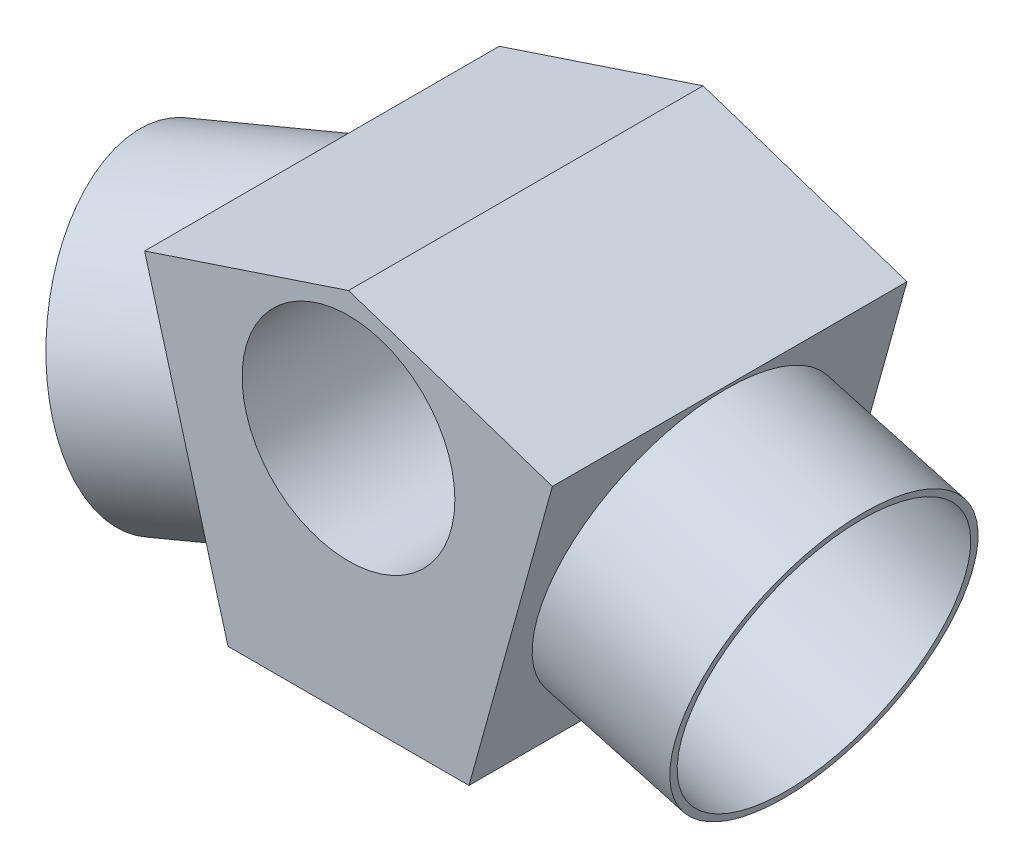
ISO-10303-21;
HEADER;
FILE_DESCRIPTION(('STEP AP214'),'2;1');
FILE_NAME('part.step','',(''),(''),'','','');
FILE_SCHEMA(('AUTOMOTIVE_DESIGN { 1 0 10303 214 1 1 1 1 }'));
ENDSEC;
DATA;
#1=APPLICATION_CONTEXT('core data for automotive mechanical design processes');
#2=APPLICATION_PROTOCOL_DEFINITION('international standard','automotive_design',2000,#1);
#3=PRODUCT_CONTEXT('',#1,'mechanical');
#4=PRODUCT('Part','Part','',(#3));
#5=PRODUCT_RELATED_PRODUCT_CATEGORY('part','',(#4));
#6=PRODUCT_DEFINITION_FORMATION('','',#4);
#7=PRODUCT_DEFINITION_CONTEXT('part definition',#1,'design');
#8=PRODUCT_DEFINITION('design','',#6,#7);
#9=PRODUCT_DEFINITION_SHAPE('','',#8);
#10=(LENGTH_UNIT() NAMED_UNIT(*) SI_UNIT(.MILLI.,.METRE.));
#11=(NAMED_UNIT(*) PLANE_ANGLE_UNIT() SI_UNIT($,.RADIAN.));
#12=(NAMED_UNIT(*) SI_UNIT($,.STERADIAN.) SOLID_ANGLE_UNIT());
#13=UNCERTAINTY_MEASURE_WITH_UNIT(LENGTH_MEASURE(1.E-05),#10,'distance_accuracy_value','');
#14=(GEOMETRIC_REPRESENTATION_CONTEXT(3) GLOBAL_UNCERTAINTY_ASSIGNED_CONTEXT((#13)) GLOBAL_UNIT_ASSIGNED_CONTEXT((#10,
#11,#12)) REPRESENTATION_CONTEXT('',''));
#15=CARTESIAN_POINT('',(0.,0.,0.));
#16=DIRECTION('',(0.,0.,1.));
#17=DIRECTION('',(1.,0.,0.));
#18=AXIS2_PLACEMENT_3D('',#15,#16,#17);
#19=CARTESIAN_POINT('',(0.,9.02241335596712,-25.));
#20=DIRECTION('',(0.315177046038834,0.949032891764155,0.));
#21=DIRECTION('',(-0.949032891764155,0.315177046038834,0.));
#22=AXIS2_PLACEMENT_3D('',#19,#20,#21);
#23=PLANE('',#22);
#24=DIRECTION('',(-0.949032891764155,0.315177046038834,0.));
#25=VECTOR('',#24,1.);
#26=CARTESIAN_POINT('',(0.,9.02241335596712,0.));
#27=LINE('',#26,#25);
#28=CARTESIAN_POINT('',(14.3742711389531,4.24866909920602,0.));
#29=VERTEX_POINT('',#28);
#30=CARTESIAN_POINT('',(0.,9.02241335596712,0.));
#31=VERTEX_POINT('',#30);
#32=EDGE_CURVE('E133',#29,#31,#27,.T.);
#33=ORIENTED_EDGE('',*,*,#32,.F.);
#34=DIRECTION('',(0.,0.,1.));
#35=VECTOR('',#34,1.);
#36=CARTESIAN_POINT('',(14.3742711389531,4.24866909920602,-25.));
#37=LINE('',#36,#35);
#38=CARTESIAN_POINT('',(14.3742711389531,4.24866909920602,-25.));
#39=VERTEX_POINT('',#38);
#40=EDGE_CURVE('E70',#39,#29,#37,.T.);
#41=ORIENTED_EDGE('',*,*,#40,.F.);
#42=DIRECTION('',(-0.949032891764155,0.315177046038834,0.));
#43=VECTOR('',#42,1.);
#44=CARTESIAN_POINT('',(0.,9.02241335596712,-25.));
#45=LINE('',#44,#43);
#46=CARTESIAN_POINT('',(0.,9.02241335596712,-25.));
#47=VERTEX_POINT('',#46);
#48=EDGE_CURVE('E128',#39,#47,#45,.T.);
#49=ORIENTED_EDGE('',*,*,#48,.T.);
#50=DIRECTION('',(0.,0.,1.));
#51=VECTOR('',#50,1.);
#52=CARTESIAN_POINT('',(0.,9.02241335596712,-25.));
#53=LINE('',#52,#51);
#54=EDGE_CURVE('E102',#47,#31,#53,.T.);
#55=ORIENTED_EDGE('',*,*,#54,.T.);
#56=EDGE_LOOP('',(#33,#41,#49,#55));
#57=FACE_BOUND('',#56,.T.);
#58=ADVANCED_FACE('F54',(#57),#23,.T.);
#59=CARTESIAN_POINT('',(14.3742711389531,4.24866909920602,-25.));
#60=DIRECTION('',(0.963630453208622,-0.267238376078261,0.));
#61=DIRECTION('',(0.267238376078261,0.963630453208622,0.));
#62=AXIS2_PLACEMENT_3D('',#59,#60,#61);
#63=PLANE('',#62);
#64=CARTESIAN_POINT('',(11.5001030027421,-6.11524638456314,-12.3158082499231));
#65=DIRECTION('',(0.963630453208622,-0.267238376078261,0.));
#66=DIRECTION('',(0.267238376078261,0.963630453208622,0.));
#67=AXIS2_PLACEMENT_3D('',#64,#65,#66);
#68=CIRCLE('',#67,10.5);
#69=CARTESIAN_POINT('',(14.3061059515638,4.00287337412739,-12.3158082499231));
#70=VERTEX_POINT('',#69);
#71=EDGE_CURVE('E12',#70,#70,#68,.T.);
#72=ORIENTED_EDGE('',*,*,#71,.F.);
#73=EDGE_LOOP('',(#72));
#74=FACE_BOUND('',#73,.T.);
#75=DIRECTION('',(0.267238376078261,0.963630453208622,0.));
#76=VECTOR('',#75,1.);
#77=CARTESIAN_POINT('',(14.3742711389531,4.24866909920602,0.));
#78=LINE('',#77,#76);
#79=CARTESIAN_POINT('',(8.4950268652314,-16.9512008713837,0.));
#80=VERTEX_POINT('',#79);
#81=EDGE_CURVE('E143',#80,#29,#78,.T.);
#82=ORIENTED_EDGE('',*,*,#81,.F.);
#83=DIRECTION('',(0.,0.,1.));
#84=VECTOR('',#83,1.);
#85=CARTESIAN_POINT('',(8.4950268652314,-16.9512008713837,-25.));
#86=LINE('',#85,#84);
#87=CARTESIAN_POINT('',(8.4950268652314,-16.9512008713837,-25.));
#88=VERTEX_POINT('',#87);
#89=EDGE_CURVE('E90',#88,#80,#86,.T.);
#90=ORIENTED_EDGE('',*,*,#89,.F.);
#91=DIRECTION('',(0.267238376078261,0.963630453208622,0.));
#92=VECTOR('',#91,1.);
#93=CARTESIAN_POINT('',(14.3742711389531,4.24866909920602,-25.));
#94=LINE('',#93,#92);
#95=EDGE_CURVE('E123',#88,#39,#94,.T.);
#96=ORIENTED_EDGE('',*,*,#95,.T.);
#97=ORIENTED_EDGE('',*,*,#40,.T.);
#98=EDGE_LOOP('',(#82,#90,#96,#97));
#99=FACE_BOUND('',#98,.T.);
#100=ADVANCED_FACE('F170',(#74,#99),#63,.T.);
#101=CARTESIAN_POINT('',(-8.4950268652314,-16.9512008713837,-25.));
#102=DIRECTION('',(0.,-1.,0.));
#103=DIRECTION('',(0.,0.,-1.));
#104=AXIS2_PLACEMENT_3D('',#101,#102,#103);
#105=PLANE('',#104);
#106=DIRECTION('',(1.,0.,0.));
#107=VECTOR('',#106,1.);
#108=CARTESIAN_POINT('',(-8.4950268652314,-16.9512008713837,0.));
#109=LINE('',#108,#107);
#110=CARTESIAN_POINT('',(-8.4950268652314,-16.9512008713837,0.));
#111=VERTEX_POINT('',#110);
#112=EDGE_CURVE('E112',#111,#80,#109,.T.);
#113=ORIENTED_EDGE('',*,*,#112,.F.);
#114=DIRECTION('',(0.,0.,1.));
#115=VECTOR('',#114,1.);
#116=CARTESIAN_POINT('',(-8.4950268652314,-16.9512008713837,-25.));
#117=LINE('',#116,#115);
#118=CARTESIAN_POINT('',(-8.4950268652314,-16.9512008713837,-25.));
#119=VERTEX_POINT('',#118);
#120=EDGE_CURVE('E107',#119,#111,#117,.T.);
#121=ORIENTED_EDGE('',*,*,#120,.F.);
#122=DIRECTION('',(1.,0.,0.));
#123=VECTOR('',#122,1.);
#124=CARTESIAN_POINT('',(-8.4950268652314,-16.9512008713837,-25.));
#125=LINE('',#124,#123);
#126=EDGE_CURVE('E110',#119,#88,#125,.T.);
#127=ORIENTED_EDGE('',*,*,#126,.T.);
#128=ORIENTED_EDGE('',*,*,#89,.T.);
#129=EDGE_LOOP('',(#113,#121,#127,#128));
#130=FACE_BOUND('',#129,.T.);
#131=ADVANCED_FACE('F109',(#130),#105,.T.);
#132=CARTESIAN_POINT('',(-14.3742711389531,4.24866909920602,-25.));
#133=DIRECTION('',(-0.963630453208622,-0.267238376078261,0.));
#134=DIRECTION('',(0.267238376078261,-0.963630453208622,0.));
#135=AXIS2_PLACEMENT_3D('',#132,#133,#134);
#136=PLANE('',#135);
#137=CARTESIAN_POINT('',(-11.4346490020923,-6.35126588608882,-12.5));
#138=DIRECTION('',(-0.963630453208622,-0.267238376078261,0.));
#139=DIRECTION('',(0.,0.,1.));
#140=AXIS2_PLACEMENT_3D('',#137,#138,#139);
#141=ELLIPSE('',#140,10.7779978073166,10.5);
#142=CARTESIAN_POINT('',(-11.4346490020923,-6.35126588608882,-1.72200219268343));
#143=VERTEX_POINT('',#142);
#144=EDGE_CURVE('E151',#143,#143,#141,.F.);
#145=ORIENTED_EDGE('',*,*,#144,.T.);
#146=EDGE_LOOP('',(#145));
#147=FACE_BOUND('',#146,.T.);
#148=DIRECTION('',(0.267238376078261,-0.963630453208622,0.));
#149=VECTOR('',#148,1.);
#150=CARTESIAN_POINT('',(-14.3742711389531,4.24866909920602,0.));
#151=LINE('',#150,#149);
#152=CARTESIAN_POINT('',(-14.3742711389531,4.24866909920602,0.));
#153=VERTEX_POINT('',#152);
#154=EDGE_CURVE('E140',#153,#111,#151,.T.);
#155=ORIENTED_EDGE('',*,*,#154,.F.);
#156=DIRECTION('',(0.,0.,1.));
#157=VECTOR('',#156,1.);
#158=CARTESIAN_POINT('',(-14.3742711389531,4.24866909920602,-25.));
#159=LINE('',#158,#157);
#160=CARTESIAN_POINT('',(-14.3742711389531,4.24866909920602,-25.));
#161=VERTEX_POINT('',#160);
#162=EDGE_CURVE('E117',#161,#153,#159,.T.);
#163=ORIENTED_EDGE('',*,*,#162,.F.);
#164=DIRECTION('',(0.267238376078261,-0.963630453208622,0.));
#165=VECTOR('',#164,1.);
#166=CARTESIAN_POINT('',(-14.3742711389531,4.24866909920602,-25.));
#167=LINE('',#166,#165);
#168=EDGE_CURVE('E122',#161,#119,#167,.T.);
#169=ORIENTED_EDGE('',*,*,#168,.T.);
#170=ORIENTED_EDGE('',*,*,#120,.T.);
#171=EDGE_LOOP('',(#155,#163,#169,#170));
#172=FACE_BOUND('',#171,.T.);
#173=ADVANCED_FACE('F125',(#147,#172),#136,.T.);
#174=CARTESIAN_POINT('',(0.,9.02241335596712,-25.));
#175=DIRECTION('',(-0.315177046038834,0.949032891764155,0.));
#176=DIRECTION('',(-0.949032891764155,-0.315177046038834,0.));
#177=AXIS2_PLACEMENT_3D('',#174,#175,#176);
#178=PLANE('',#177);
#179=DIRECTION('',(-0.949032891764155,-0.315177046038834,0.));
#180=VECTOR('',#179,1.);
#181=CARTESIAN_POINT('',(0.,9.02241335596712,0.));
#182=LINE('',#181,#180);
#183=EDGE_CURVE('E136',#31,#153,#182,.T.);
#184=ORIENTED_EDGE('',*,*,#183,.F.);
#185=ORIENTED_EDGE('',*,*,#54,.F.);
#186=DIRECTION('',(-0.949032891764155,-0.315177046038834,0.));
#187=VECTOR('',#186,1.);
#188=CARTESIAN_POINT('',(0.,9.02241335596712,-25.));
#189=LINE('',#188,#187);
#190=EDGE_CURVE('E126',#47,#161,#189,.T.);
#191=ORIENTED_EDGE('',*,*,#190,.T.);
#192=ORIENTED_EDGE('',*,*,#162,.T.);
#193=EDGE_LOOP('',(#184,#185,#191,#192));
#194=FACE_BOUND('',#193,.T.);
#195=ADVANCED_FACE('F173',(#194),#178,.T.);
#196=CARTESIAN_POINT('',(0.,0.,-25.));
#197=DIRECTION('',(0.,0.,-1.));
#198=DIRECTION('',(-1.,0.,0.));
#199=AXIS2_PLACEMENT_3D('',#196,#197,#198);
#200=PLANE('',#199);
#201=CARTESIAN_POINT('',(0.,0.,-25.));
#202=DIRECTION('',(0.,0.,1.));
#203=DIRECTION('',(1.,0.,0.));
#204=AXIS2_PLACEMENT_3D('',#201,#202,#203);
#205=CIRCLE('',#204,7.5);
#206=CARTESIAN_POINT('',(7.5,0.,-25.));
#207=VERTEX_POINT('',#206);
#208=EDGE_CURVE('E137',#207,#207,#205,.T.);
#209=ORIENTED_EDGE('',*,*,#208,.T.);
#210=EDGE_LOOP('',(#209));
#211=FACE_BOUND('',#210,.T.);
#212=ORIENTED_EDGE('',*,*,#48,.F.);
#213=ORIENTED_EDGE('',*,*,#95,.F.);
#214=ORIENTED_EDGE('',*,*,#126,.F.);
#215=ORIENTED_EDGE('',*,*,#168,.F.);
#216=ORIENTED_EDGE('',*,*,#190,.F.);
#217=EDGE_LOOP('',(#212,#213,#214,#215,#216));
#218=FACE_BOUND('',#217,.T.);
#219=ADVANCED_FACE('F121',(#211,#218),#200,.T.);
#220=CARTESIAN_POINT('',(0.,0.,0.));
#221=DIRECTION('',(0.,0.,-1.));
#222=DIRECTION('',(-1.,0.,0.));
#223=AXIS2_PLACEMENT_3D('',#220,#221,#222);
#224=PLANE('',#223);
#225=CARTESIAN_POINT('',(0.,0.,0.));
#226=DIRECTION('',(0.,0.,1.));
#227=DIRECTION('',(1.,0.,0.));
#228=AXIS2_PLACEMENT_3D('',#225,#226,#227);
#229=CIRCLE('',#228,7.5);
#230=CARTESIAN_POINT('',(7.5,0.,0.));
#231=VERTEX_POINT('',#230);
#232=EDGE_CURVE('E153',#231,#231,#229,.T.);
#233=ORIENTED_EDGE('',*,*,#232,.F.);
#234=EDGE_LOOP('',(#233));
#235=FACE_BOUND('',#234,.T.);
#236=ORIENTED_EDGE('',*,*,#32,.T.);
#237=ORIENTED_EDGE('',*,*,#183,.T.);
#238=ORIENTED_EDGE('',*,*,#154,.T.);
#239=ORIENTED_EDGE('',*,*,#112,.T.);
#240=ORIENTED_EDGE('',*,*,#81,.T.);
#241=EDGE_LOOP('',(#236,#237,#238,#239,#240));
#242=FACE_BOUND('',#241,.T.);
#243=ADVANCED_FACE('F172',(#235,#242),#224,.F.);
#244=CARTESIAN_POINT('',(0.,0.,-25.));
#245=DIRECTION('',(0.,0.,1.));
#246=DIRECTION('',(1.,0.,0.));
#247=AXIS2_PLACEMENT_3D('',#244,#245,#246);
#248=CYLINDRICAL_SURFACE('',#247,7.5);
#249=ORIENTED_EDGE('',*,*,#208,.F.);
#250=EDGE_LOOP('',(#249));
#251=FACE_BOUND('',#250,.T.);
#252=ORIENTED_EDGE('',*,*,#232,.T.);
#253=EDGE_LOOP('',(#252));
#254=FACE_BOUND('',#253,.T.);
#255=ADVANCED_FACE('F196',(#251,#254),#248,.F.);
#256=CARTESIAN_POINT('',(-8.61832264735264,-5.57022946383693,-13.1769696970433));
#257=DIRECTION('',(-0.938775451579877,-0.260345474083962,0.225656565681116));
#258=DIRECTION('',(0.267238376078261,-0.963630453208622,0.));
#259=AXIS2_PLACEMENT_3D('',#256,#257,#258);
#260=CYLINDRICAL_SURFACE('',#259,10.5);
#261=ORIENTED_EDGE('',*,*,#144,.F.);
#262=EDGE_LOOP('',(#261));
#263=FACE_BOUND('',#262,.T.);
#264=CARTESIAN_POINT('',(-22.6999544210508,-9.47541157509637,-9.79212121182661));
#265=DIRECTION('',(0.938775451579877,0.260345474083962,-0.225656565681116));
#266=DIRECTION('',(0.267238376078261,-0.963630453208622,0.));
#267=AXIS2_PLACEMENT_3D('',#264,#265,#266);
#268=CIRCLE('',#267,10.5);
#269=CARTESIAN_POINT('',(-19.8939514722291,-19.5935313337869,-9.79212121182661));
#270=VERTEX_POINT('',#269);
#271=EDGE_CURVE('E154',#270,#270,#268,.T.);
#272=ORIENTED_EDGE('',*,*,#271,.T.);
#273=EDGE_LOOP('',(#272));
#274=FACE_BOUND('',#273,.T.);
#275=ADVANCED_FACE('F201',(#263,#274),#260,.T.);
#276=CARTESIAN_POINT('',(-8.61832264735264,-5.57022946383693,-13.1769696970433));
#277=DIRECTION('',(-0.938775451579877,-0.260345474083962,0.225656565681116));
#278=DIRECTION('',(0.267238376078261,-0.963630453208622,0.));
#279=AXIS2_PLACEMENT_3D('',#276,#277,#278);
#280=CYLINDRICAL_SURFACE('',#279,10.);
#281=CARTESIAN_POINT('',(-11.4346490020923,-6.35126588608882,-12.5));
#282=DIRECTION('',(-0.963630453208622,-0.267238376078261,0.));
#283=DIRECTION('',(0.,0.,1.));
#284=AXIS2_PLACEMENT_3D('',#281,#282,#283);
#285=ELLIPSE('',#284,10.264759816492,10.);
#286=CARTESIAN_POINT('',(-11.4346490020923,-6.35126588608882,-2.23524018350803));
#287=VERTEX_POINT('',#286);
#288=EDGE_CURVE('E62',#287,#287,#285,.F.);
#289=ORIENTED_EDGE('',*,*,#288,.T.);
#290=EDGE_LOOP('',(#289));
#291=FACE_BOUND('',#290,.T.);
#292=CARTESIAN_POINT('',(-22.6999544210508,-9.47541157509637,-9.79212121182661));
#293=DIRECTION('',(0.938775451579877,0.260345474083962,-0.225656565681116));
#294=DIRECTION('',(-0.267238376078261,0.963630453208622,0.));
#295=AXIS2_PLACEMENT_3D('',#292,#293,#294);
#296=CIRCLE('',#295,10.);
#297=CARTESIAN_POINT('',(-25.3723381818334,0.160892956989858,-9.79212121182661));
#298=VERTEX_POINT('',#297);
#299=EDGE_CURVE('E160',#298,#298,#296,.T.);
#300=ORIENTED_EDGE('',*,*,#299,.F.);
#301=EDGE_LOOP('',(#300));
#302=FACE_BOUND('',#301,.T.);
#303=ADVANCED_FACE('F205',(#291,#302),#280,.F.);
#304=CARTESIAN_POINT('',(-22.6999544210508,-9.47541157509637,-9.79212121182661));
#305=DIRECTION('',(0.938775451579877,0.260345474083962,-0.225656565681116));
#306=DIRECTION('',(-0.267238376078261,0.963630453208622,0.));
#307=AXIS2_PLACEMENT_3D('',#304,#305,#306);
#308=PLANE('',#307);
#309=ORIENTED_EDGE('',*,*,#299,.T.);
#310=EDGE_LOOP('',(#309));
#311=FACE_BOUND('',#310,.T.);
#312=ORIENTED_EDGE('',*,*,#271,.F.);
#313=EDGE_LOOP('',(#312));
#314=FACE_BOUND('',#313,.T.);
#315=ADVANCED_FACE('F209',(#311,#314),#308,.F.);
#316=ORIENTED_EDGE('',*,*,#288,.F.);
#317=EDGE_LOOP('',(#316));
#318=FACE_BOUND('',#317,.T.);
#319=ADVANCED_FACE('F182',(#318),#136,.T.);
#320=CARTESIAN_POINT('',(9.64008677654258,-5.59941823268846,-12.3158082499231));
#321=DIRECTION('',(0.963630453208623,-0.267238376078257,0.));
#322=DIRECTION('',(0.267238376078258,0.963630453208623,0.));
#323=AXIS2_PLACEMENT_3D('',#320,#321,#322);
#324=CYLINDRICAL_SURFACE('',#323,10.5);
#325=ORIENTED_EDGE('',*,*,#71,.T.);
#326=EDGE_LOOP('',(#325));
#327=FACE_BOUND('',#326,.T.);
#328=CARTESIAN_POINT('',(21.2036522150461,-8.80627874562755,-12.3158082499231));
#329=DIRECTION('',(0.963630453208623,-0.267238376078257,0.));
#330=DIRECTION('',(0.,0.,-1.));
#331=AXIS2_PLACEMENT_3D('',#328,#329,#330);
#332=CIRCLE('',#331,10.5);
#333=CARTESIAN_POINT('',(21.2036522150461,-8.80627874562755,-22.8158082499231));
#334=VERTEX_POINT('',#333);
#335=EDGE_CURVE('E237',#334,#334,#332,.T.);
#336=ORIENTED_EDGE('',*,*,#335,.F.);
#337=EDGE_LOOP('',(#336));
#338=FACE_BOUND('',#337,.T.);
#339=ADVANCED_FACE('F223',(#327,#338),#324,.T.);
#340=CARTESIAN_POINT('',(21.2036522150461,-8.80627874562755,-12.3158082499231));
#341=DIRECTION('',(0.963630453208623,-0.267238376078257,0.));
#342=DIRECTION('',(0.267238376078257,0.963630453208623,0.));
#343=AXIS2_PLACEMENT_3D('',#340,#341,#342);
#344=PLANE('',#343);
#345=CARTESIAN_POINT('',(21.2036522150461,-8.80627874562755,-12.3158082499231));
#346=DIRECTION('',(0.963630453208623,-0.267238376078257,0.));
#347=DIRECTION('',(0.267238376078257,0.963630453208623,0.));
#348=AXIS2_PLACEMENT_3D('',#345,#346,#347);
#349=CIRCLE('',#348,10.);
#350=CARTESIAN_POINT('',(23.8760359758286,0.830025786458686,-12.3158082499231));
#351=VERTEX_POINT('',#350);
#352=EDGE_CURVE('E234',#351,#351,#349,.T.);
#353=ORIENTED_EDGE('',*,*,#352,.F.);
#354=EDGE_LOOP('',(#353));
#355=FACE_BOUND('',#354,.T.);
#356=ORIENTED_EDGE('',*,*,#335,.T.);
#357=EDGE_LOOP('',(#356));
#358=FACE_BOUND('',#357,.T.);
#359=ADVANCED_FACE('F221',(#355,#358),#344,.T.);
#360=CARTESIAN_POINT('',(8.67645632333397,-5.3321798566102,-12.3158082499231));
#361=DIRECTION('',(0.963630453208623,-0.267238376078257,0.));
#362=DIRECTION('',(0.267238376078257,0.963630453208623,0.));
#363=AXIS2_PLACEMENT_3D('',#360,#361,#362);
#364=PLANE('',#363);
#365=CARTESIAN_POINT('',(8.67645632333397,-5.3321798566102,-12.3158082499231));
#366=DIRECTION('',(0.963630453208623,-0.267238376078257,0.));
#367=DIRECTION('',(0.267238376078257,0.963630453208623,0.));
#368=AXIS2_PLACEMENT_3D('',#365,#366,#367);
#369=CIRCLE('',#368,10.);
#370=CARTESIAN_POINT('',(11.3488400841165,4.30412467547603,-12.3158082499231));
#371=VERTEX_POINT('',#370);
#372=EDGE_CURVE('E165',#371,#371,#369,.T.);
#373=ORIENTED_EDGE('',*,*,#372,.T.);
#374=EDGE_LOOP('',(#373));
#375=FACE_BOUND('',#374,.T.);
#376=ADVANCED_FACE('F217',(#375),#364,.T.);
#377=CARTESIAN_POINT('',(8.67645632333397,-5.3321798566102,-12.3158082499231));
#378=DIRECTION('',(0.963630453208623,-0.267238376078257,0.));
#379=DIRECTION('',(0.267238376078257,0.963630453208623,0.));
#380=AXIS2_PLACEMENT_3D('',#377,#378,#379);
#381=CYLINDRICAL_SURFACE('',#380,10.);
#382=ORIENTED_EDGE('',*,*,#372,.F.);
#383=EDGE_LOOP('',(#382));
#384=FACE_BOUND('',#383,.T.);
#385=ORIENTED_EDGE('',*,*,#352,.T.);
#386=EDGE_LOOP('',(#385));
#387=FACE_BOUND('',#386,.T.);
#388=ADVANCED_FACE('F214',(#384,#387),#381,.F.);
#389=CLOSED_SHELL('',(#58,#100,#131,#173,#195,#219,#243,#255,#275,#303,#315,#319,#339,#359,#376,#388));
#390=MANIFOLD_SOLID_BREP('B2',#389);
#391=ADVANCED_BREP_SHAPE_REPRESENTATION('',(#18,#390),#14);
#392=SHAPE_DEFINITION_REPRESENTATION(#9,#391);
ENDSEC;
END-ISO-10303-21;
